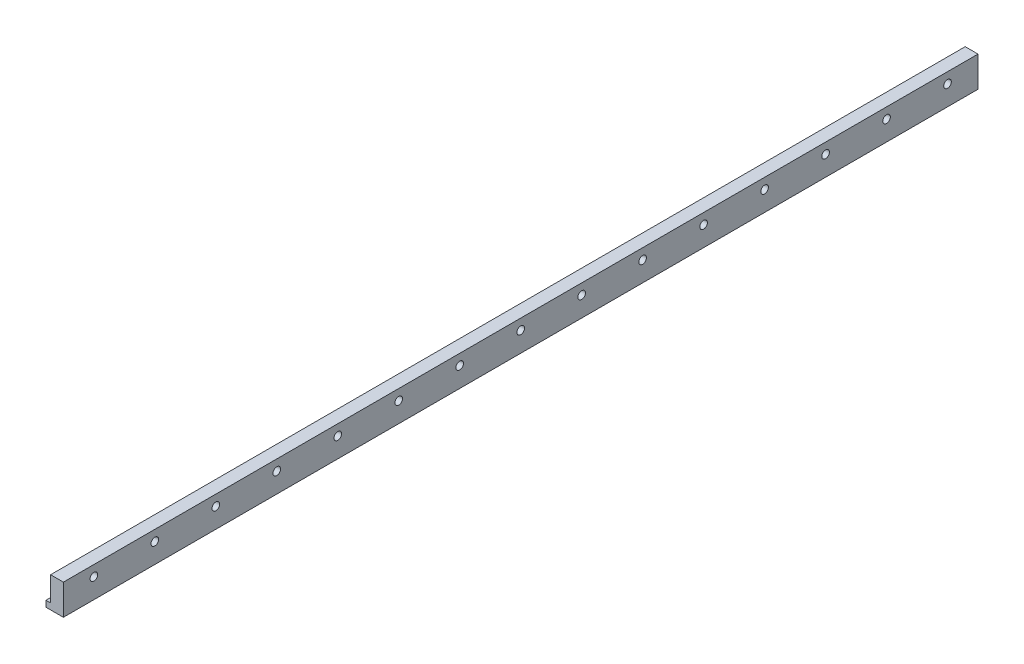
ISO-10303-21;
HEADER;
FILE_DESCRIPTION(('STEP AP214'),'2;1');
FILE_NAME('part.step','',(''),(''),'','','');
FILE_SCHEMA(('AUTOMOTIVE_DESIGN { 1 0 10303 214 1 1 1 1 }'));
ENDSEC;
DATA;
#1=APPLICATION_CONTEXT('core data for automotive mechanical design processes');
#2=APPLICATION_PROTOCOL_DEFINITION('international standard','automotive_design',2000,#1);
#3=PRODUCT_CONTEXT('',#1,'mechanical');
#4=PRODUCT('Part','Part','',(#3));
#5=PRODUCT_RELATED_PRODUCT_CATEGORY('part','',(#4));
#6=PRODUCT_DEFINITION_FORMATION('','',#4);
#7=PRODUCT_DEFINITION_CONTEXT('part definition',#1,'design');
#8=PRODUCT_DEFINITION('design','',#6,#7);
#9=PRODUCT_DEFINITION_SHAPE('','',#8);
#10=(LENGTH_UNIT() NAMED_UNIT(*) SI_UNIT(.MILLI.,.METRE.));
#11=(NAMED_UNIT(*) PLANE_ANGLE_UNIT() SI_UNIT($,.RADIAN.));
#12=(NAMED_UNIT(*) SI_UNIT($,.STERADIAN.) SOLID_ANGLE_UNIT());
#13=UNCERTAINTY_MEASURE_WITH_UNIT(LENGTH_MEASURE(1.E-05),#10,'distance_accuracy_value','');
#14=(GEOMETRIC_REPRESENTATION_CONTEXT(3) GLOBAL_UNCERTAINTY_ASSIGNED_CONTEXT((#13)) GLOBAL_UNIT_ASSIGNED_CONTEXT((#10,
#11,#12)) REPRESENTATION_CONTEXT('',''));
#15=CARTESIAN_POINT('',(0.,0.,0.));
#16=DIRECTION('',(0.,0.,1.));
#17=DIRECTION('',(1.,0.,0.));
#18=AXIS2_PLACEMENT_3D('',#15,#16,#17);
#19=CARTESIAN_POINT('',(-2.1,0.,140.));
#20=DIRECTION('',(-1.,0.,0.));
#21=DIRECTION('',(0.,0.,1.));
#22=AXIS2_PLACEMENT_3D('',#19,#20,#21);
#23=CYLINDRICAL_SURFACE('',#22,1.25);
#24=CARTESIAN_POINT('',(2.1,0.,140.));
#25=DIRECTION('',(-1.,0.,0.));
#26=DIRECTION('',(0.,0.,1.));
#27=AXIS2_PLACEMENT_3D('',#24,#25,#26);
#28=CIRCLE('',#27,1.25);
#29=CARTESIAN_POINT('',(2.1,0.,141.25));
#30=VERTEX_POINT('',#29);
#31=EDGE_CURVE('E44',#30,#30,#28,.T.);
#32=ORIENTED_EDGE('',*,*,#31,.F.);
#33=EDGE_LOOP('',(#32));
#34=FACE_BOUND('',#33,.T.);
#35=CARTESIAN_POINT('',(-2.1,0.,140.));
#36=DIRECTION('',(-1.,0.,0.));
#37=DIRECTION('',(0.,0.,1.));
#38=AXIS2_PLACEMENT_3D('',#35,#36,#37);
#39=CIRCLE('',#38,1.25);
#40=CARTESIAN_POINT('',(-2.1,0.,141.25));
#41=VERTEX_POINT('',#40);
#42=EDGE_CURVE('E11',#41,#41,#39,.T.);
#43=ORIENTED_EDGE('',*,*,#42,.T.);
#44=EDGE_LOOP('',(#43));
#45=FACE_BOUND('',#44,.T.);
#46=ADVANCED_FACE('F37',(#34,#45),#23,.F.);
#47=CARTESIAN_POINT('',(-2.1,0.,120.));
#48=DIRECTION('',(-1.,0.,0.));
#49=DIRECTION('',(0.,0.,1.));
#50=AXIS2_PLACEMENT_3D('',#47,#48,#49);
#51=CYLINDRICAL_SURFACE('',#50,1.25);
#52=CARTESIAN_POINT('',(2.1,0.,120.));
#53=DIRECTION('',(-1.,0.,0.));
#54=DIRECTION('',(0.,0.,1.));
#55=AXIS2_PLACEMENT_3D('',#52,#53,#54);
#56=CIRCLE('',#55,1.25);
#57=CARTESIAN_POINT('',(2.1,0.,121.25));
#58=VERTEX_POINT('',#57);
#59=EDGE_CURVE('E189',#58,#58,#56,.T.);
#60=ORIENTED_EDGE('',*,*,#59,.F.);
#61=EDGE_LOOP('',(#60));
#62=FACE_BOUND('',#61,.T.);
#63=CARTESIAN_POINT('',(-2.1,0.,120.));
#64=DIRECTION('',(-1.,0.,0.));
#65=DIRECTION('',(0.,0.,1.));
#66=AXIS2_PLACEMENT_3D('',#63,#64,#65);
#67=CIRCLE('',#66,1.25);
#68=CARTESIAN_POINT('',(-2.1,0.,121.25));
#69=VERTEX_POINT('',#68);
#70=EDGE_CURVE('E192',#69,#69,#67,.T.);
#71=ORIENTED_EDGE('',*,*,#70,.T.);
#72=EDGE_LOOP('',(#71));
#73=FACE_BOUND('',#72,.T.);
#74=ADVANCED_FACE('F200',(#62,#73),#51,.F.);
#75=CARTESIAN_POINT('',(-2.1,0.,100.));
#76=DIRECTION('',(-1.,0.,0.));
#77=DIRECTION('',(0.,0.,1.));
#78=AXIS2_PLACEMENT_3D('',#75,#76,#77);
#79=CYLINDRICAL_SURFACE('',#78,1.25);
#80=CARTESIAN_POINT('',(2.1,0.,100.));
#81=DIRECTION('',(-1.,0.,0.));
#82=DIRECTION('',(0.,0.,1.));
#83=AXIS2_PLACEMENT_3D('',#80,#81,#82);
#84=CIRCLE('',#83,1.25);
#85=CARTESIAN_POINT('',(2.1,0.,101.25));
#86=VERTEX_POINT('',#85);
#87=EDGE_CURVE('E183',#86,#86,#84,.T.);
#88=ORIENTED_EDGE('',*,*,#87,.F.);
#89=EDGE_LOOP('',(#88));
#90=FACE_BOUND('',#89,.T.);
#91=CARTESIAN_POINT('',(-2.1,0.,100.));
#92=DIRECTION('',(-1.,0.,0.));
#93=DIRECTION('',(0.,0.,1.));
#94=AXIS2_PLACEMENT_3D('',#91,#92,#93);
#95=CIRCLE('',#94,1.25);
#96=CARTESIAN_POINT('',(-2.1,0.,101.25));
#97=VERTEX_POINT('',#96);
#98=EDGE_CURVE('E186',#97,#97,#95,.T.);
#99=ORIENTED_EDGE('',*,*,#98,.T.);
#100=EDGE_LOOP('',(#99));
#101=FACE_BOUND('',#100,.T.);
#102=ADVANCED_FACE('F255',(#90,#101),#79,.F.);
#103=CARTESIAN_POINT('',(-2.1,0.,80.));
#104=DIRECTION('',(-1.,0.,0.));
#105=DIRECTION('',(0.,0.,1.));
#106=AXIS2_PLACEMENT_3D('',#103,#104,#105);
#107=CYLINDRICAL_SURFACE('',#106,1.25);
#108=CARTESIAN_POINT('',(2.1,0.,80.));
#109=DIRECTION('',(-1.,0.,0.));
#110=DIRECTION('',(0.,0.,1.));
#111=AXIS2_PLACEMENT_3D('',#108,#109,#110);
#112=CIRCLE('',#111,1.25);
#113=CARTESIAN_POINT('',(2.1,0.,81.25));
#114=VERTEX_POINT('',#113);
#115=EDGE_CURVE('E176',#114,#114,#112,.T.);
#116=ORIENTED_EDGE('',*,*,#115,.F.);
#117=EDGE_LOOP('',(#116));
#118=FACE_BOUND('',#117,.T.);
#119=CARTESIAN_POINT('',(-2.1,0.,80.));
#120=DIRECTION('',(-1.,0.,0.));
#121=DIRECTION('',(0.,0.,1.));
#122=AXIS2_PLACEMENT_3D('',#119,#120,#121);
#123=CIRCLE('',#122,1.25);
#124=CARTESIAN_POINT('',(-2.1,0.,81.25));
#125=VERTEX_POINT('',#124);
#126=EDGE_CURVE('E180',#125,#125,#123,.T.);
#127=ORIENTED_EDGE('',*,*,#126,.T.);
#128=EDGE_LOOP('',(#127));
#129=FACE_BOUND('',#128,.T.);
#130=ADVANCED_FACE('F251',(#118,#129),#107,.F.);
#131=CARTESIAN_POINT('',(-2.1,0.,60.));
#132=DIRECTION('',(-1.,0.,0.));
#133=DIRECTION('',(0.,0.,1.));
#134=AXIS2_PLACEMENT_3D('',#131,#132,#133);
#135=CYLINDRICAL_SURFACE('',#134,1.25);
#136=CARTESIAN_POINT('',(2.1,0.,60.));
#137=DIRECTION('',(-1.,0.,0.));
#138=DIRECTION('',(0.,0.,1.));
#139=AXIS2_PLACEMENT_3D('',#136,#137,#138);
#140=CIRCLE('',#139,1.25);
#141=CARTESIAN_POINT('',(2.1,0.,61.25));
#142=VERTEX_POINT('',#141);
#143=EDGE_CURVE('E170',#142,#142,#140,.T.);
#144=ORIENTED_EDGE('',*,*,#143,.F.);
#145=EDGE_LOOP('',(#144));
#146=FACE_BOUND('',#145,.T.);
#147=CARTESIAN_POINT('',(-2.1,0.,60.));
#148=DIRECTION('',(-1.,0.,0.));
#149=DIRECTION('',(0.,0.,1.));
#150=AXIS2_PLACEMENT_3D('',#147,#148,#149);
#151=CIRCLE('',#150,1.25);
#152=CARTESIAN_POINT('',(-2.1,0.,61.25));
#153=VERTEX_POINT('',#152);
#154=EDGE_CURVE('E173',#153,#153,#151,.T.);
#155=ORIENTED_EDGE('',*,*,#154,.T.);
#156=EDGE_LOOP('',(#155));
#157=FACE_BOUND('',#156,.T.);
#158=ADVANCED_FACE('F247',(#146,#157),#135,.F.);
#159=CARTESIAN_POINT('',(-2.1,0.,40.));
#160=DIRECTION('',(-1.,0.,0.));
#161=DIRECTION('',(0.,0.,1.));
#162=AXIS2_PLACEMENT_3D('',#159,#160,#161);
#163=CYLINDRICAL_SURFACE('',#162,1.25);
#164=CARTESIAN_POINT('',(2.1,0.,40.));
#165=DIRECTION('',(-1.,0.,0.));
#166=DIRECTION('',(0.,0.,1.));
#167=AXIS2_PLACEMENT_3D('',#164,#165,#166);
#168=CIRCLE('',#167,1.25);
#169=CARTESIAN_POINT('',(2.1,0.,41.25));
#170=VERTEX_POINT('',#169);
#171=EDGE_CURVE('E164',#170,#170,#168,.T.);
#172=ORIENTED_EDGE('',*,*,#171,.F.);
#173=EDGE_LOOP('',(#172));
#174=FACE_BOUND('',#173,.T.);
#175=CARTESIAN_POINT('',(-2.1,0.,40.));
#176=DIRECTION('',(-1.,0.,0.));
#177=DIRECTION('',(0.,0.,1.));
#178=AXIS2_PLACEMENT_3D('',#175,#176,#177);
#179=CIRCLE('',#178,1.25);
#180=CARTESIAN_POINT('',(-2.1,0.,41.25));
#181=VERTEX_POINT('',#180);
#182=EDGE_CURVE('E167',#181,#181,#179,.T.);
#183=ORIENTED_EDGE('',*,*,#182,.T.);
#184=EDGE_LOOP('',(#183));
#185=FACE_BOUND('',#184,.T.);
#186=ADVANCED_FACE('F243',(#174,#185),#163,.F.);
#187=CARTESIAN_POINT('',(-2.1,0.,20.));
#188=DIRECTION('',(-1.,0.,0.));
#189=DIRECTION('',(0.,0.,1.));
#190=AXIS2_PLACEMENT_3D('',#187,#188,#189);
#191=CYLINDRICAL_SURFACE('',#190,1.25);
#192=CARTESIAN_POINT('',(2.1,0.,20.));
#193=DIRECTION('',(-1.,0.,0.));
#194=DIRECTION('',(0.,0.,1.));
#195=AXIS2_PLACEMENT_3D('',#192,#193,#194);
#196=CIRCLE('',#195,1.25);
#197=CARTESIAN_POINT('',(2.1,0.,21.25));
#198=VERTEX_POINT('',#197);
#199=EDGE_CURVE('E158',#198,#198,#196,.T.);
#200=ORIENTED_EDGE('',*,*,#199,.F.);
#201=EDGE_LOOP('',(#200));
#202=FACE_BOUND('',#201,.T.);
#203=CARTESIAN_POINT('',(-2.1,0.,20.));
#204=DIRECTION('',(-1.,0.,0.));
#205=DIRECTION('',(0.,0.,1.));
#206=AXIS2_PLACEMENT_3D('',#203,#204,#205);
#207=CIRCLE('',#206,1.25);
#208=CARTESIAN_POINT('',(-2.1,0.,21.25));
#209=VERTEX_POINT('',#208);
#210=EDGE_CURVE('E161',#209,#209,#207,.T.);
#211=ORIENTED_EDGE('',*,*,#210,.T.);
#212=EDGE_LOOP('',(#211));
#213=FACE_BOUND('',#212,.T.);
#214=ADVANCED_FACE('F239',(#202,#213),#191,.F.);
#215=CARTESIAN_POINT('',(-2.1,0.,0.));
#216=DIRECTION('',(-1.,0.,0.));
#217=DIRECTION('',(0.,0.,1.));
#218=AXIS2_PLACEMENT_3D('',#215,#216,#217);
#219=CYLINDRICAL_SURFACE('',#218,1.25);
#220=CARTESIAN_POINT('',(2.1,0.,0.));
#221=DIRECTION('',(-1.,0.,0.));
#222=DIRECTION('',(0.,0.,1.));
#223=AXIS2_PLACEMENT_3D('',#220,#221,#222);
#224=CIRCLE('',#223,1.25);
#225=CARTESIAN_POINT('',(2.1,0.,1.25000000000003));
#226=VERTEX_POINT('',#225);
#227=EDGE_CURVE('E151',#226,#226,#224,.T.);
#228=ORIENTED_EDGE('',*,*,#227,.F.);
#229=EDGE_LOOP('',(#228));
#230=FACE_BOUND('',#229,.T.);
#231=CARTESIAN_POINT('',(-2.1,0.,0.));
#232=DIRECTION('',(-1.,0.,0.));
#233=DIRECTION('',(0.,0.,1.));
#234=AXIS2_PLACEMENT_3D('',#231,#232,#233);
#235=CIRCLE('',#234,1.25);
#236=CARTESIAN_POINT('',(-2.1,0.,1.25000000000003));
#237=VERTEX_POINT('',#236);
#238=EDGE_CURVE('E155',#237,#237,#235,.T.);
#239=ORIENTED_EDGE('',*,*,#238,.T.);
#240=EDGE_LOOP('',(#239));
#241=FACE_BOUND('',#240,.T.);
#242=ADVANCED_FACE('F235',(#230,#241),#219,.F.);
#243=CARTESIAN_POINT('',(-2.1,0.,-20.));
#244=DIRECTION('',(-1.,0.,0.));
#245=DIRECTION('',(0.,0.,1.));
#246=AXIS2_PLACEMENT_3D('',#243,#244,#245);
#247=CYLINDRICAL_SURFACE('',#246,1.25);
#248=CARTESIAN_POINT('',(2.1,0.,-20.));
#249=DIRECTION('',(-1.,0.,0.));
#250=DIRECTION('',(0.,0.,1.));
#251=AXIS2_PLACEMENT_3D('',#248,#249,#250);
#252=CIRCLE('',#251,1.25);
#253=CARTESIAN_POINT('',(2.1,0.,-18.75));
#254=VERTEX_POINT('',#253);
#255=EDGE_CURVE('E145',#254,#254,#252,.T.);
#256=ORIENTED_EDGE('',*,*,#255,.F.);
#257=EDGE_LOOP('',(#256));
#258=FACE_BOUND('',#257,.T.);
#259=CARTESIAN_POINT('',(-2.1,0.,-20.));
#260=DIRECTION('',(-1.,0.,0.));
#261=DIRECTION('',(0.,0.,1.));
#262=AXIS2_PLACEMENT_3D('',#259,#260,#261);
#263=CIRCLE('',#262,1.25);
#264=CARTESIAN_POINT('',(-2.1,0.,-18.75));
#265=VERTEX_POINT('',#264);
#266=EDGE_CURVE('E148',#265,#265,#263,.T.);
#267=ORIENTED_EDGE('',*,*,#266,.T.);
#268=EDGE_LOOP('',(#267));
#269=FACE_BOUND('',#268,.T.);
#270=ADVANCED_FACE('F231',(#258,#269),#247,.F.);
#271=CARTESIAN_POINT('',(-2.1,0.,-40.));
#272=DIRECTION('',(-1.,0.,0.));
#273=DIRECTION('',(0.,0.,1.));
#274=AXIS2_PLACEMENT_3D('',#271,#272,#273);
#275=CYLINDRICAL_SURFACE('',#274,1.25);
#276=CARTESIAN_POINT('',(2.1,0.,-40.));
#277=DIRECTION('',(-1.,0.,0.));
#278=DIRECTION('',(0.,0.,1.));
#279=AXIS2_PLACEMENT_3D('',#276,#277,#278);
#280=CIRCLE('',#279,1.25);
#281=CARTESIAN_POINT('',(2.1,0.,-38.75));
#282=VERTEX_POINT('',#281);
#283=EDGE_CURVE('E139',#282,#282,#280,.T.);
#284=ORIENTED_EDGE('',*,*,#283,.F.);
#285=EDGE_LOOP('',(#284));
#286=FACE_BOUND('',#285,.T.);
#287=CARTESIAN_POINT('',(-2.1,0.,-40.));
#288=DIRECTION('',(-1.,0.,0.));
#289=DIRECTION('',(0.,0.,1.));
#290=AXIS2_PLACEMENT_3D('',#287,#288,#289);
#291=CIRCLE('',#290,1.25);
#292=CARTESIAN_POINT('',(-2.1,0.,-38.75));
#293=VERTEX_POINT('',#292);
#294=EDGE_CURVE('E142',#293,#293,#291,.T.);
#295=ORIENTED_EDGE('',*,*,#294,.T.);
#296=EDGE_LOOP('',(#295));
#297=FACE_BOUND('',#296,.T.);
#298=ADVANCED_FACE('F227',(#286,#297),#275,.F.);
#299=CARTESIAN_POINT('',(-2.1,0.,-60.));
#300=DIRECTION('',(-1.,0.,0.));
#301=DIRECTION('',(0.,0.,1.));
#302=AXIS2_PLACEMENT_3D('',#299,#300,#301);
#303=CYLINDRICAL_SURFACE('',#302,1.25);
#304=CARTESIAN_POINT('',(2.1,0.,-60.));
#305=DIRECTION('',(-1.,0.,0.));
#306=DIRECTION('',(0.,0.,1.));
#307=AXIS2_PLACEMENT_3D('',#304,#305,#306);
#308=CIRCLE('',#307,1.25);
#309=CARTESIAN_POINT('',(2.1,0.,-58.75));
#310=VERTEX_POINT('',#309);
#311=EDGE_CURVE('E133',#310,#310,#308,.T.);
#312=ORIENTED_EDGE('',*,*,#311,.F.);
#313=EDGE_LOOP('',(#312));
#314=FACE_BOUND('',#313,.T.);
#315=CARTESIAN_POINT('',(-2.1,0.,-60.));
#316=DIRECTION('',(-1.,0.,0.));
#317=DIRECTION('',(0.,0.,1.));
#318=AXIS2_PLACEMENT_3D('',#315,#316,#317);
#319=CIRCLE('',#318,1.25);
#320=CARTESIAN_POINT('',(-2.1,0.,-58.75));
#321=VERTEX_POINT('',#320);
#322=EDGE_CURVE('E136',#321,#321,#319,.T.);
#323=ORIENTED_EDGE('',*,*,#322,.T.);
#324=EDGE_LOOP('',(#323));
#325=FACE_BOUND('',#324,.T.);
#326=ADVANCED_FACE('F223',(#314,#325),#303,.F.);
#327=CARTESIAN_POINT('',(-2.1,0.,-80.));
#328=DIRECTION('',(-1.,0.,0.));
#329=DIRECTION('',(0.,0.,1.));
#330=AXIS2_PLACEMENT_3D('',#327,#328,#329);
#331=CYLINDRICAL_SURFACE('',#330,1.25);
#332=CARTESIAN_POINT('',(2.1,0.,-80.));
#333=DIRECTION('',(-1.,0.,0.));
#334=DIRECTION('',(0.,0.,1.));
#335=AXIS2_PLACEMENT_3D('',#332,#333,#334);
#336=CIRCLE('',#335,1.25);
#337=CARTESIAN_POINT('',(2.1,0.,-78.75));
#338=VERTEX_POINT('',#337);
#339=EDGE_CURVE('E127',#338,#338,#336,.T.);
#340=ORIENTED_EDGE('',*,*,#339,.F.);
#341=EDGE_LOOP('',(#340));
#342=FACE_BOUND('',#341,.T.);
#343=CARTESIAN_POINT('',(-2.1,0.,-80.));
#344=DIRECTION('',(-1.,0.,0.));
#345=DIRECTION('',(0.,0.,1.));
#346=AXIS2_PLACEMENT_3D('',#343,#344,#345);
#347=CIRCLE('',#346,1.25);
#348=CARTESIAN_POINT('',(-2.1,0.,-78.75));
#349=VERTEX_POINT('',#348);
#350=EDGE_CURVE('E130',#349,#349,#347,.T.);
#351=ORIENTED_EDGE('',*,*,#350,.T.);
#352=EDGE_LOOP('',(#351));
#353=FACE_BOUND('',#352,.T.);
#354=ADVANCED_FACE('F214',(#342,#353),#331,.F.);
#355=CARTESIAN_POINT('',(-2.1,0.,-100.));
#356=DIRECTION('',(-1.,0.,0.));
#357=DIRECTION('',(0.,0.,1.));
#358=AXIS2_PLACEMENT_3D('',#355,#356,#357);
#359=CYLINDRICAL_SURFACE('',#358,1.25);
#360=CARTESIAN_POINT('',(2.1,0.,-100.));
#361=DIRECTION('',(-1.,0.,0.));
#362=DIRECTION('',(0.,0.,1.));
#363=AXIS2_PLACEMENT_3D('',#360,#361,#362);
#364=CIRCLE('',#363,1.25);
#365=CARTESIAN_POINT('',(2.1,0.,-98.75));
#366=VERTEX_POINT('',#365);
#367=EDGE_CURVE('E113',#366,#366,#364,.T.);
#368=ORIENTED_EDGE('',*,*,#367,.F.);
#369=EDGE_LOOP('',(#368));
#370=FACE_BOUND('',#369,.T.);
#371=CARTESIAN_POINT('',(-2.1,0.,-100.));
#372=DIRECTION('',(-1.,0.,0.));
#373=DIRECTION('',(0.,0.,1.));
#374=AXIS2_PLACEMENT_3D('',#371,#372,#373);
#375=CIRCLE('',#374,1.25);
#376=CARTESIAN_POINT('',(-2.1,0.,-98.75));
#377=VERTEX_POINT('',#376);
#378=EDGE_CURVE('E124',#377,#377,#375,.T.);
#379=ORIENTED_EDGE('',*,*,#378,.T.);
#380=EDGE_LOOP('',(#379));
#381=FACE_BOUND('',#380,.T.);
#382=ADVANCED_FACE('F205',(#370,#381),#359,.F.);
#383=CARTESIAN_POINT('',(-2.1,4.525,150.));
#384=DIRECTION('',(1.,0.,0.));
#385=DIRECTION('',(0.,0.,-1.));
#386=AXIS2_PLACEMENT_3D('',#383,#384,#385);
#387=PLANE('',#386);
#388=CARTESIAN_POINT('',(-2.1,0.,-120.));
#389=DIRECTION('',(-1.,0.,0.));
#390=DIRECTION('',(0.,0.,1.));
#391=AXIS2_PLACEMENT_3D('',#388,#389,#390);
#392=CIRCLE('',#391,1.25);
#393=CARTESIAN_POINT('',(-2.1,0.,-118.75));
#394=VERTEX_POINT('',#393);
#395=EDGE_CURVE('E410',#394,#394,#392,.T.);
#396=ORIENTED_EDGE('',*,*,#395,.F.);
#397=EDGE_LOOP('',(#396));
#398=FACE_BOUND('',#397,.T.);
#399=CARTESIAN_POINT('',(-2.1,0.,-140.));
#400=DIRECTION('',(-1.,0.,0.));
#401=DIRECTION('',(0.,0.,1.));
#402=AXIS2_PLACEMENT_3D('',#399,#400,#401);
#403=CIRCLE('',#402,1.25);
#404=CARTESIAN_POINT('',(-2.1,0.,-138.75));
#405=VERTEX_POINT('',#404);
#406=EDGE_CURVE('E409',#405,#405,#403,.T.);
#407=ORIENTED_EDGE('',*,*,#406,.F.);
#408=EDGE_LOOP('',(#407));
#409=FACE_BOUND('',#408,.T.);
#410=DIRECTION('',(0.,-1.,0.));
#411=VECTOR('',#410,1.);
#412=CARTESIAN_POINT('',(-2.1,4.525,150.));
#413=LINE('',#412,#411);
#414=CARTESIAN_POINT('',(-2.1,3.475,150.));
#415=VERTEX_POINT('',#414);
#416=CARTESIAN_POINT('',(-2.1,-4.525,150.));
#417=VERTEX_POINT('',#416);
#418=EDGE_CURVE('E59',#415,#417,#413,.T.);
#419=ORIENTED_EDGE('',*,*,#418,.F.);
#420=DIRECTION('',(0.,0.,-1.));
#421=VECTOR('',#420,1.);
#422=CARTESIAN_POINT('',(-2.1,3.475,150.));
#423=LINE('',#422,#421);
#424=CARTESIAN_POINT('',(-2.1,3.475,-150.));
#425=VERTEX_POINT('',#424);
#426=EDGE_CURVE('E90',#415,#425,#423,.T.);
#427=ORIENTED_EDGE('',*,*,#426,.T.);
#428=DIRECTION('',(0.,-1.,0.));
#429=VECTOR('',#428,1.);
#430=CARTESIAN_POINT('',(-2.1,4.525,-150.));
#431=LINE('',#430,#429);
#432=CARTESIAN_POINT('',(-2.1,-4.525,-150.));
#433=VERTEX_POINT('',#432);
#434=EDGE_CURVE('E118',#425,#433,#431,.T.);
#435=ORIENTED_EDGE('',*,*,#434,.T.);
#436=DIRECTION('',(0.,0.,-1.));
#437=VECTOR('',#436,1.);
#438=CARTESIAN_POINT('',(-2.1,-4.525,150.));
#439=LINE('',#438,#437);
#440=EDGE_CURVE('E109',#417,#433,#439,.T.);
#441=ORIENTED_EDGE('',*,*,#440,.F.);
#442=EDGE_LOOP('',(#419,#427,#435,#441));
#443=FACE_BOUND('',#442,.T.);
#444=ORIENTED_EDGE('',*,*,#378,.F.);
#445=EDGE_LOOP('',(#444));
#446=FACE_BOUND('',#445,.T.);
#447=ORIENTED_EDGE('',*,*,#350,.F.);
#448=EDGE_LOOP('',(#447));
#449=FACE_BOUND('',#448,.T.);
#450=ORIENTED_EDGE('',*,*,#322,.F.);
#451=EDGE_LOOP('',(#450));
#452=FACE_BOUND('',#451,.T.);
#453=ORIENTED_EDGE('',*,*,#294,.F.);
#454=EDGE_LOOP('',(#453));
#455=FACE_BOUND('',#454,.T.);
#456=ORIENTED_EDGE('',*,*,#266,.F.);
#457=EDGE_LOOP('',(#456));
#458=FACE_BOUND('',#457,.T.);
#459=ORIENTED_EDGE('',*,*,#238,.F.);
#460=EDGE_LOOP('',(#459));
#461=FACE_BOUND('',#460,.T.);
#462=ORIENTED_EDGE('',*,*,#210,.F.);
#463=EDGE_LOOP('',(#462));
#464=FACE_BOUND('',#463,.T.);
#465=ORIENTED_EDGE('',*,*,#182,.F.);
#466=EDGE_LOOP('',(#465));
#467=FACE_BOUND('',#466,.T.);
#468=ORIENTED_EDGE('',*,*,#154,.F.);
#469=EDGE_LOOP('',(#468));
#470=FACE_BOUND('',#469,.T.);
#471=ORIENTED_EDGE('',*,*,#126,.F.);
#472=EDGE_LOOP('',(#471));
#473=FACE_BOUND('',#472,.T.);
#474=ORIENTED_EDGE('',*,*,#98,.F.);
#475=EDGE_LOOP('',(#474));
#476=FACE_BOUND('',#475,.T.);
#477=ORIENTED_EDGE('',*,*,#70,.F.);
#478=EDGE_LOOP('',(#477));
#479=FACE_BOUND('',#478,.T.);
#480=ORIENTED_EDGE('',*,*,#42,.F.);
#481=EDGE_LOOP('',(#480));
#482=FACE_BOUND('',#481,.T.);
#483=ADVANCED_FACE('F203',(#398,#409,#443,#446,#449,#452,#455,#458,#461,#464,#467,#470,#473,
#476,#479,#482),#387,.F.);
#484=CARTESIAN_POINT('',(2.1,4.525,150.));
#485=DIRECTION('',(-1.,0.,0.));
#486=DIRECTION('',(0.,0.,1.));
#487=AXIS2_PLACEMENT_3D('',#484,#485,#486);
#488=PLANE('',#487);
#489=CARTESIAN_POINT('',(2.1,0.,-120.));
#490=DIRECTION('',(-1.,0.,0.));
#491=DIRECTION('',(0.,0.,1.));
#492=AXIS2_PLACEMENT_3D('',#489,#490,#491);
#493=CIRCLE('',#492,1.25);
#494=CARTESIAN_POINT('',(2.1,0.,-118.75));
#495=VERTEX_POINT('',#494);
#496=EDGE_CURVE('E413',#495,#495,#493,.T.);
#497=ORIENTED_EDGE('',*,*,#496,.T.);
#498=EDGE_LOOP('',(#497));
#499=FACE_BOUND('',#498,.T.);
#500=CARTESIAN_POINT('',(2.1,0.,-140.));
#501=DIRECTION('',(-1.,0.,0.));
#502=DIRECTION('',(0.,0.,1.));
#503=AXIS2_PLACEMENT_3D('',#500,#501,#502);
#504=CIRCLE('',#503,1.25);
#505=CARTESIAN_POINT('',(2.1,0.,-138.75));
#506=VERTEX_POINT('',#505);
#507=EDGE_CURVE('E120',#506,#506,#504,.T.);
#508=ORIENTED_EDGE('',*,*,#507,.T.);
#509=EDGE_LOOP('',(#508));
#510=FACE_BOUND('',#509,.T.);
#511=DIRECTION('',(0.,1.,0.));
#512=VECTOR('',#511,1.);
#513=CARTESIAN_POINT('',(2.1,4.525,-150.));
#514=LINE('',#513,#512);
#515=CARTESIAN_POINT('',(2.1,-6.525,-150.));
#516=VERTEX_POINT('',#515);
#517=CARTESIAN_POINT('',(2.1,3.475,-150.));
#518=VERTEX_POINT('',#517);
#519=EDGE_CURVE('E101',#516,#518,#514,.T.);
#520=ORIENTED_EDGE('',*,*,#519,.T.);
#521=DIRECTION('',(0.,0.,1.));
#522=VECTOR('',#521,1.);
#523=CARTESIAN_POINT('',(2.1,3.475,-150.));
#524=LINE('',#523,#522);
#525=CARTESIAN_POINT('',(2.1,3.475,150.));
#526=VERTEX_POINT('',#525);
#527=EDGE_CURVE('E51',#518,#526,#524,.T.);
#528=ORIENTED_EDGE('',*,*,#527,.T.);
#529=DIRECTION('',(0.,1.,0.));
#530=VECTOR('',#529,1.);
#531=CARTESIAN_POINT('',(2.1,4.525,150.));
#532=LINE('',#531,#530);
#533=CARTESIAN_POINT('',(2.1,-6.525,150.));
#534=VERTEX_POINT('',#533);
#535=EDGE_CURVE('E99',#534,#526,#532,.T.);
#536=ORIENTED_EDGE('',*,*,#535,.F.);
#537=DIRECTION('',(0.,0.,1.));
#538=VECTOR('',#537,1.);
#539=CARTESIAN_POINT('',(2.1,-6.525,-156.040695324216));
#540=LINE('',#539,#538);
#541=EDGE_CURVE('E418',#516,#534,#540,.T.);
#542=ORIENTED_EDGE('',*,*,#541,.F.);
#543=EDGE_LOOP('',(#520,#528,#536,#542));
#544=FACE_BOUND('',#543,.T.);
#545=ORIENTED_EDGE('',*,*,#367,.T.);
#546=EDGE_LOOP('',(#545));
#547=FACE_BOUND('',#546,.T.);
#548=ORIENTED_EDGE('',*,*,#339,.T.);
#549=EDGE_LOOP('',(#548));
#550=FACE_BOUND('',#549,.T.);
#551=ORIENTED_EDGE('',*,*,#311,.T.);
#552=EDGE_LOOP('',(#551));
#553=FACE_BOUND('',#552,.T.);
#554=ORIENTED_EDGE('',*,*,#283,.T.);
#555=EDGE_LOOP('',(#554));
#556=FACE_BOUND('',#555,.T.);
#557=ORIENTED_EDGE('',*,*,#255,.T.);
#558=EDGE_LOOP('',(#557));
#559=FACE_BOUND('',#558,.T.);
#560=ORIENTED_EDGE('',*,*,#227,.T.);
#561=EDGE_LOOP('',(#560));
#562=FACE_BOUND('',#561,.T.);
#563=ORIENTED_EDGE('',*,*,#199,.T.);
#564=EDGE_LOOP('',(#563));
#565=FACE_BOUND('',#564,.T.);
#566=ORIENTED_EDGE('',*,*,#171,.T.);
#567=EDGE_LOOP('',(#566));
#568=FACE_BOUND('',#567,.T.);
#569=ORIENTED_EDGE('',*,*,#143,.T.);
#570=EDGE_LOOP('',(#569));
#571=FACE_BOUND('',#570,.T.);
#572=ORIENTED_EDGE('',*,*,#115,.T.);
#573=EDGE_LOOP('',(#572));
#574=FACE_BOUND('',#573,.T.);
#575=ORIENTED_EDGE('',*,*,#87,.T.);
#576=EDGE_LOOP('',(#575));
#577=FACE_BOUND('',#576,.T.);
#578=ORIENTED_EDGE('',*,*,#59,.T.);
#579=EDGE_LOOP('',(#578));
#580=FACE_BOUND('',#579,.T.);
#581=ORIENTED_EDGE('',*,*,#31,.T.);
#582=EDGE_LOOP('',(#581));
#583=FACE_BOUND('',#582,.T.);
#584=ADVANCED_FACE('F96',(#499,#510,#544,#547,#550,#553,#556,#559,#562,#565,#568,#571,#574,#577,
#580,#583),#488,.F.);
#585=CARTESIAN_POINT('',(0.,0.,150.));
#586=DIRECTION('',(0.,0.,-1.));
#587=DIRECTION('',(-1.,0.,0.));
#588=AXIS2_PLACEMENT_3D('',#585,#586,#587);
#589=PLANE('',#588);
#590=ORIENTED_EDGE('',*,*,#535,.T.);
#591=DIRECTION('',(1.,0.,0.));
#592=VECTOR('',#591,1.);
#593=CARTESIAN_POINT('',(2.1,3.475,150.));
#594=LINE('',#593,#592);
#595=EDGE_CURVE('E87',#415,#526,#594,.T.);
#596=ORIENTED_EDGE('',*,*,#595,.F.);
#597=ORIENTED_EDGE('',*,*,#418,.T.);
#598=DIRECTION('',(-1.,0.,0.));
#599=VECTOR('',#598,1.);
#600=CARTESIAN_POINT('',(2.1,-4.525,150.));
#601=LINE('',#600,#599);
#602=CARTESIAN_POINT('',(-3.6,-4.525,150.));
#603=VERTEX_POINT('',#602);
#604=EDGE_CURVE('E435',#417,#603,#601,.T.);
#605=ORIENTED_EDGE('',*,*,#604,.T.);
#606=DIRECTION('',(0.,-1.,0.));
#607=VECTOR('',#606,1.);
#608=CARTESIAN_POINT('',(-3.6,-4.525,150.));
#609=LINE('',#608,#607);
#610=CARTESIAN_POINT('',(-3.6,-6.525,150.));
#611=VERTEX_POINT('',#610);
#612=EDGE_CURVE('E437',#603,#611,#609,.T.);
#613=ORIENTED_EDGE('',*,*,#612,.T.);
#614=DIRECTION('',(1.,0.,0.));
#615=VECTOR('',#614,1.);
#616=CARTESIAN_POINT('',(2.1,-6.525,150.));
#617=LINE('',#616,#615);
#618=EDGE_CURVE('E108',#611,#534,#617,.T.);
#619=ORIENTED_EDGE('',*,*,#618,.T.);
#620=EDGE_LOOP('',(#590,#596,#597,#605,#613,#619));
#621=FACE_BOUND('',#620,.T.);
#622=ADVANCED_FACE('F105',(#621),#589,.F.);
#623=CARTESIAN_POINT('',(0.,0.,-150.));
#624=DIRECTION('',(0.,0.,-1.));
#625=DIRECTION('',(-1.,0.,0.));
#626=AXIS2_PLACEMENT_3D('',#623,#624,#625);
#627=PLANE('',#626);
#628=DIRECTION('',(1.,0.,0.));
#629=VECTOR('',#628,1.);
#630=CARTESIAN_POINT('',(2.1,3.475,-150.));
#631=LINE('',#630,#629);
#632=EDGE_CURVE('E92',#425,#518,#631,.T.);
#633=ORIENTED_EDGE('',*,*,#632,.T.);
#634=ORIENTED_EDGE('',*,*,#519,.F.);
#635=DIRECTION('',(1.,0.,0.));
#636=VECTOR('',#635,1.);
#637=CARTESIAN_POINT('',(2.1,-6.525,-150.));
#638=LINE('',#637,#636);
#639=CARTESIAN_POINT('',(-3.6,-6.525,-150.));
#640=VERTEX_POINT('',#639);
#641=EDGE_CURVE('E428',#640,#516,#638,.T.);
#642=ORIENTED_EDGE('',*,*,#641,.F.);
#643=DIRECTION('',(0.,-1.,0.));
#644=VECTOR('',#643,1.);
#645=CARTESIAN_POINT('',(-3.6,-4.525,-150.));
#646=LINE('',#645,#644);
#647=CARTESIAN_POINT('',(-3.6,-4.525,-150.));
#648=VERTEX_POINT('',#647);
#649=EDGE_CURVE('E423',#648,#640,#646,.T.);
#650=ORIENTED_EDGE('',*,*,#649,.F.);
#651=DIRECTION('',(-1.,0.,0.));
#652=VECTOR('',#651,1.);
#653=CARTESIAN_POINT('',(2.1,-4.525,-150.));
#654=LINE('',#653,#652);
#655=EDGE_CURVE('E424',#433,#648,#654,.T.);
#656=ORIENTED_EDGE('',*,*,#655,.F.);
#657=ORIENTED_EDGE('',*,*,#434,.F.);
#658=EDGE_LOOP('',(#633,#634,#642,#650,#656,#657));
#659=FACE_BOUND('',#658,.T.);
#660=ADVANCED_FACE('F382',(#659),#627,.T.);
#661=CARTESIAN_POINT('',(-2.1,0.,-140.));
#662=DIRECTION('',(-1.,0.,0.));
#663=DIRECTION('',(0.,0.,1.));
#664=AXIS2_PLACEMENT_3D('',#661,#662,#663);
#665=CYLINDRICAL_SURFACE('',#664,1.25);
#666=ORIENTED_EDGE('',*,*,#507,.F.);
#667=EDGE_LOOP('',(#666));
#668=FACE_BOUND('',#667,.T.);
#669=ORIENTED_EDGE('',*,*,#406,.T.);
#670=EDGE_LOOP('',(#669));
#671=FACE_BOUND('',#670,.T.);
#672=ADVANCED_FACE('F325',(#668,#671),#665,.F.);
#673=CARTESIAN_POINT('',(-2.1,0.,-120.));
#674=DIRECTION('',(-1.,0.,0.));
#675=DIRECTION('',(0.,0.,1.));
#676=AXIS2_PLACEMENT_3D('',#673,#674,#675);
#677=CYLINDRICAL_SURFACE('',#676,1.25);
#678=ORIENTED_EDGE('',*,*,#496,.F.);
#679=EDGE_LOOP('',(#678));
#680=FACE_BOUND('',#679,.T.);
#681=ORIENTED_EDGE('',*,*,#395,.T.);
#682=EDGE_LOOP('',(#681));
#683=FACE_BOUND('',#682,.T.);
#684=ADVANCED_FACE('F320',(#680,#683),#677,.F.);
#685=CARTESIAN_POINT('',(2.1,-4.525,-156.040695324216));
#686=DIRECTION('',(0.,1.,0.));
#687=DIRECTION('',(0.,0.,1.));
#688=AXIS2_PLACEMENT_3D('',#685,#686,#687);
#689=PLANE('',#688);
#690=ORIENTED_EDGE('',*,*,#604,.F.);
#691=ORIENTED_EDGE('',*,*,#440,.T.);
#692=ORIENTED_EDGE('',*,*,#655,.T.);
#693=DIRECTION('',(0.,0.,1.));
#694=VECTOR('',#693,1.);
#695=CARTESIAN_POINT('',(-3.6,-4.525,-156.040695324216));
#696=LINE('',#695,#694);
#697=EDGE_CURVE('E419',#648,#603,#696,.T.);
#698=ORIENTED_EDGE('',*,*,#697,.T.);
#699=EDGE_LOOP('',(#690,#691,#692,#698));
#700=FACE_BOUND('',#699,.T.);
#701=ADVANCED_FACE('F324',(#700),#689,.T.);
#702=CARTESIAN_POINT('',(-3.6,-4.525,-156.040695324216));
#703=DIRECTION('',(-1.,0.,0.));
#704=DIRECTION('',(0.,0.,1.));
#705=AXIS2_PLACEMENT_3D('',#702,#703,#704);
#706=PLANE('',#705);
#707=ORIENTED_EDGE('',*,*,#697,.F.);
#708=ORIENTED_EDGE('',*,*,#649,.T.);
#709=DIRECTION('',(0.,0.,1.));
#710=VECTOR('',#709,1.);
#711=CARTESIAN_POINT('',(-3.6,-6.525,-156.040695324216));
#712=LINE('',#711,#710);
#713=EDGE_CURVE('E425',#640,#611,#712,.T.);
#714=ORIENTED_EDGE('',*,*,#713,.T.);
#715=ORIENTED_EDGE('',*,*,#612,.F.);
#716=EDGE_LOOP('',(#707,#708,#714,#715));
#717=FACE_BOUND('',#716,.T.);
#718=ADVANCED_FACE('F337',(#717),#706,.T.);
#719=CARTESIAN_POINT('',(2.1,-6.525,-156.040695324216));
#720=DIRECTION('',(0.,-1.,0.));
#721=DIRECTION('',(0.,0.,-1.));
#722=AXIS2_PLACEMENT_3D('',#719,#720,#721);
#723=PLANE('',#722);
#724=ORIENTED_EDGE('',*,*,#713,.F.);
#725=ORIENTED_EDGE('',*,*,#641,.T.);
#726=ORIENTED_EDGE('',*,*,#541,.T.);
#727=ORIENTED_EDGE('',*,*,#618,.F.);
#728=EDGE_LOOP('',(#724,#725,#726,#727));
#729=FACE_BOUND('',#728,.T.);
#730=ADVANCED_FACE('F348',(#729),#723,.T.);
#731=CARTESIAN_POINT('',(2.1,3.475,-150.));
#732=DIRECTION('',(0.,-1.,0.));
#733=DIRECTION('',(1.,0.,0.));
#734=AXIS2_PLACEMENT_3D('',#731,#732,#733);
#735=PLANE('',#734);
#736=ORIENTED_EDGE('',*,*,#595,.T.);
#737=ORIENTED_EDGE('',*,*,#527,.F.);
#738=ORIENTED_EDGE('',*,*,#632,.F.);
#739=ORIENTED_EDGE('',*,*,#426,.F.);
#740=EDGE_LOOP('',(#736,#737,#738,#739));
#741=FACE_BOUND('',#740,.T.);
#742=ADVANCED_FACE('F88',(#741),#735,.F.);
#743=CLOSED_SHELL('',(#46,#74,#102,#130,#158,#186,#214,#242,#270,#298,#326,#354,#382,#483,#584,
#622,#660,#672,#684,#701,#718,#730,#742));
#744=MANIFOLD_SOLID_BREP('B2',#743);
#745=ADVANCED_BREP_SHAPE_REPRESENTATION('',(#18,#744),#14);
#746=SHAPE_DEFINITION_REPRESENTATION(#9,#745);
ENDSEC;
END-ISO-10303-21;
